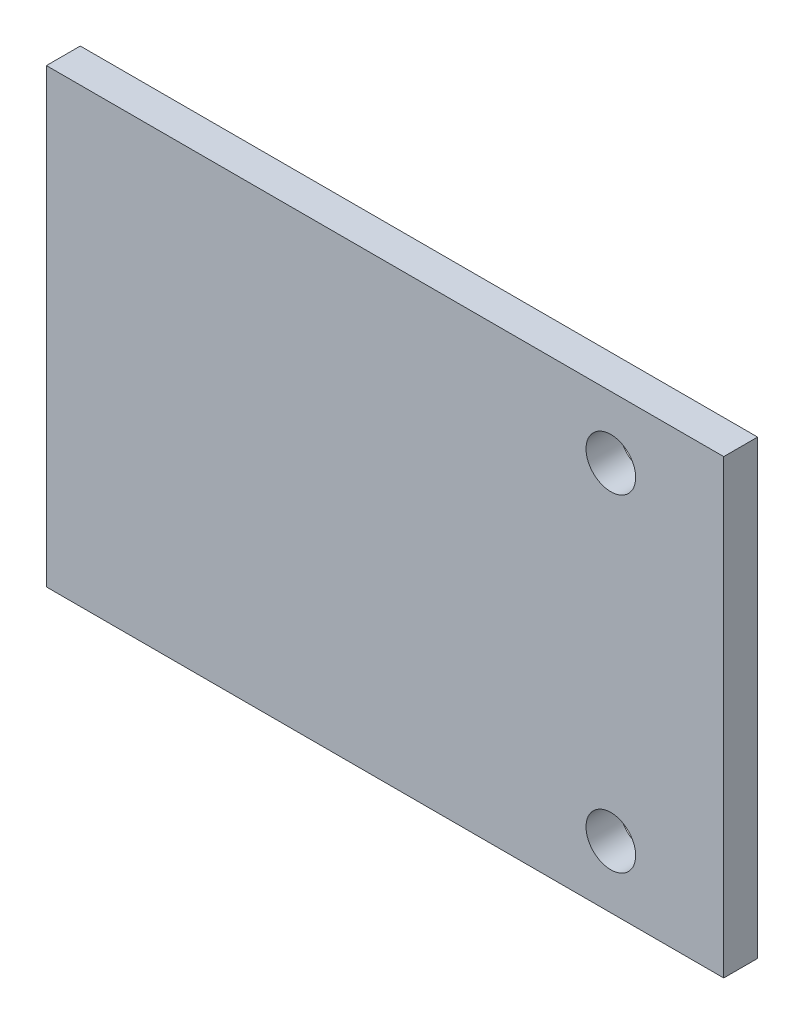
ISO-10303-21;
HEADER;
FILE_DESCRIPTION(('STEP AP214'),'2;1');
FILE_NAME('part.step','',(''),(''),'','','');
FILE_SCHEMA(('AUTOMOTIVE_DESIGN { 1 0 10303 214 1 1 1 1 }'));
ENDSEC;
DATA;
#1=APPLICATION_CONTEXT('core data for automotive mechanical design processes');
#2=APPLICATION_PROTOCOL_DEFINITION('international standard','automotive_design',2000,#1);
#3=PRODUCT_CONTEXT('',#1,'mechanical');
#4=PRODUCT('Part','Part','',(#3));
#5=PRODUCT_RELATED_PRODUCT_CATEGORY('part','',(#4));
#6=PRODUCT_DEFINITION_FORMATION('','',#4);
#7=PRODUCT_DEFINITION_CONTEXT('part definition',#1,'design');
#8=PRODUCT_DEFINITION('design','',#6,#7);
#9=PRODUCT_DEFINITION_SHAPE('','',#8);
#10=(LENGTH_UNIT() NAMED_UNIT(*) SI_UNIT(.MILLI.,.METRE.));
#11=(NAMED_UNIT(*) PLANE_ANGLE_UNIT() SI_UNIT($,.RADIAN.));
#12=(NAMED_UNIT(*) SI_UNIT($,.STERADIAN.) SOLID_ANGLE_UNIT());
#13=UNCERTAINTY_MEASURE_WITH_UNIT(LENGTH_MEASURE(1.E-05),#10,'distance_accuracy_value','');
#14=(GEOMETRIC_REPRESENTATION_CONTEXT(3) GLOBAL_UNCERTAINTY_ASSIGNED_CONTEXT((#13)) GLOBAL_UNIT_ASSIGNED_CONTEXT((#10,
#11,#12)) REPRESENTATION_CONTEXT('',''));
#15=CARTESIAN_POINT('',(0.,0.,0.));
#16=DIRECTION('',(0.,0.,1.));
#17=DIRECTION('',(1.,0.,0.));
#18=AXIS2_PLACEMENT_3D('',#15,#16,#17);
#19=CARTESIAN_POINT('',(30.,20.,3.));
#20=DIRECTION('',(-1.,0.,0.));
#21=DIRECTION('',(0.,-1.,0.));
#22=AXIS2_PLACEMENT_3D('',#19,#20,#21);
#23=PLANE('',#22);
#24=DIRECTION('',(0.,1.,0.));
#25=VECTOR('',#24,1.);
#26=CARTESIAN_POINT('',(30.,20.,0.));
#27=LINE('',#26,#25);
#28=CARTESIAN_POINT('',(30.,-20.,0.));
#29=VERTEX_POINT('',#28);
#30=CARTESIAN_POINT('',(30.,20.,0.));
#31=VERTEX_POINT('',#30);
#32=EDGE_CURVE('E99',#29,#31,#27,.T.);
#33=ORIENTED_EDGE('',*,*,#32,.T.);
#34=DIRECTION('',(0.,0.,-1.));
#35=VECTOR('',#34,1.);
#36=CARTESIAN_POINT('',(30.,20.,3.));
#37=LINE('',#36,#35);
#38=CARTESIAN_POINT('',(30.,20.,3.));
#39=VERTEX_POINT('',#38);
#40=EDGE_CURVE('E11',#39,#31,#37,.T.);
#41=ORIENTED_EDGE('',*,*,#40,.F.);
#42=DIRECTION('',(0.,1.,0.));
#43=VECTOR('',#42,1.);
#44=CARTESIAN_POINT('',(30.,20.,3.));
#45=LINE('',#44,#43);
#46=CARTESIAN_POINT('',(30.,-20.,3.));
#47=VERTEX_POINT('',#46);
#48=EDGE_CURVE('E87',#47,#39,#45,.T.);
#49=ORIENTED_EDGE('',*,*,#48,.F.);
#50=DIRECTION('',(0.,0.,-1.));
#51=VECTOR('',#50,1.);
#52=CARTESIAN_POINT('',(30.,-20.,3.));
#53=LINE('',#52,#51);
#54=EDGE_CURVE('E95',#47,#29,#53,.T.);
#55=ORIENTED_EDGE('',*,*,#54,.T.);
#56=EDGE_LOOP('',(#33,#41,#49,#55));
#57=FACE_BOUND('',#56,.T.);
#58=ADVANCED_FACE('F36',(#57),#23,.F.);
#59=CARTESIAN_POINT('',(-30.,20.,3.));
#60=DIRECTION('',(0.,-1.,0.));
#61=DIRECTION('',(0.,0.,-1.));
#62=AXIS2_PLACEMENT_3D('',#59,#60,#61);
#63=PLANE('',#62);
#64=DIRECTION('',(-1.,0.,0.));
#65=VECTOR('',#64,1.);
#66=CARTESIAN_POINT('',(-30.,20.,0.));
#67=LINE('',#66,#65);
#68=CARTESIAN_POINT('',(-30.,20.,0.));
#69=VERTEX_POINT('',#68);
#70=EDGE_CURVE('E91',#31,#69,#67,.T.);
#71=ORIENTED_EDGE('',*,*,#70,.T.);
#72=DIRECTION('',(0.,0.,-1.));
#73=VECTOR('',#72,1.);
#74=CARTESIAN_POINT('',(-30.,20.,3.));
#75=LINE('',#74,#73);
#76=CARTESIAN_POINT('',(-30.,20.,3.));
#77=VERTEX_POINT('',#76);
#78=EDGE_CURVE('E44',#77,#69,#75,.T.);
#79=ORIENTED_EDGE('',*,*,#78,.F.);
#80=DIRECTION('',(-1.,0.,0.));
#81=VECTOR('',#80,1.);
#82=CARTESIAN_POINT('',(-30.,20.,3.));
#83=LINE('',#82,#81);
#84=EDGE_CURVE('E82',#39,#77,#83,.T.);
#85=ORIENTED_EDGE('',*,*,#84,.F.);
#86=ORIENTED_EDGE('',*,*,#40,.T.);
#87=EDGE_LOOP('',(#71,#79,#85,#86));
#88=FACE_BOUND('',#87,.T.);
#89=ADVANCED_FACE('F90',(#88),#63,.F.);
#90=CARTESIAN_POINT('',(-30.,20.,3.));
#91=DIRECTION('',(1.,0.,0.));
#92=DIRECTION('',(0.,1.,0.));
#93=AXIS2_PLACEMENT_3D('',#90,#91,#92);
#94=PLANE('',#93);
#95=DIRECTION('',(0.,-1.,0.));
#96=VECTOR('',#95,1.);
#97=CARTESIAN_POINT('',(-30.,20.,0.));
#98=LINE('',#97,#96);
#99=CARTESIAN_POINT('',(-30.,-20.,0.));
#100=VERTEX_POINT('',#99);
#101=EDGE_CURVE('E69',#69,#100,#98,.T.);
#102=ORIENTED_EDGE('',*,*,#101,.T.);
#103=DIRECTION('',(0.,0.,-1.));
#104=VECTOR('',#103,1.);
#105=CARTESIAN_POINT('',(-30.,-20.,3.));
#106=LINE('',#105,#104);
#107=CARTESIAN_POINT('',(-30.,-20.,3.));
#108=VERTEX_POINT('',#107);
#109=EDGE_CURVE('E92',#108,#100,#106,.T.);
#110=ORIENTED_EDGE('',*,*,#109,.F.);
#111=DIRECTION('',(0.,-1.,0.));
#112=VECTOR('',#111,1.);
#113=CARTESIAN_POINT('',(-30.,20.,3.));
#114=LINE('',#113,#112);
#115=EDGE_CURVE('E85',#77,#108,#114,.T.);
#116=ORIENTED_EDGE('',*,*,#115,.F.);
#117=ORIENTED_EDGE('',*,*,#78,.T.);
#118=EDGE_LOOP('',(#102,#110,#116,#117));
#119=FACE_BOUND('',#118,.T.);
#120=ADVANCED_FACE('F93',(#119),#94,.F.);
#121=CARTESIAN_POINT('',(-30.,-20.,3.));
#122=DIRECTION('',(0.,1.,0.));
#123=DIRECTION('',(0.,0.,1.));
#124=AXIS2_PLACEMENT_3D('',#121,#122,#123);
#125=PLANE('',#124);
#126=DIRECTION('',(1.,0.,0.));
#127=VECTOR('',#126,1.);
#128=CARTESIAN_POINT('',(-30.,-20.,0.));
#129=LINE('',#128,#127);
#130=EDGE_CURVE('E75',#100,#29,#129,.T.);
#131=ORIENTED_EDGE('',*,*,#130,.T.);
#132=ORIENTED_EDGE('',*,*,#54,.F.);
#133=DIRECTION('',(1.,0.,0.));
#134=VECTOR('',#133,1.);
#135=CARTESIAN_POINT('',(-30.,-20.,3.));
#136=LINE('',#135,#134);
#137=EDGE_CURVE('E52',#108,#47,#136,.T.);
#138=ORIENTED_EDGE('',*,*,#137,.F.);
#139=ORIENTED_EDGE('',*,*,#109,.T.);
#140=EDGE_LOOP('',(#131,#132,#138,#139));
#141=FACE_BOUND('',#140,.T.);
#142=ADVANCED_FACE('F107',(#141),#125,.F.);
#143=CARTESIAN_POINT('',(0.,0.,3.));
#144=DIRECTION('',(0.,0.,1.));
#145=DIRECTION('',(1.,0.,0.));
#146=AXIS2_PLACEMENT_3D('',#143,#144,#145);
#147=PLANE('',#146);
#148=CARTESIAN_POINT('',(20.,14.5,3.));
#149=DIRECTION('',(0.,0.,1.));
#150=DIRECTION('',(1.,0.,0.));
#151=AXIS2_PLACEMENT_3D('',#148,#149,#150);
#152=CIRCLE('',#151,2.2);
#153=CARTESIAN_POINT('',(22.2,14.5,3.));
#154=VERTEX_POINT('',#153);
#155=EDGE_CURVE('E119',#154,#154,#152,.T.);
#156=ORIENTED_EDGE('',*,*,#155,.F.);
#157=EDGE_LOOP('',(#156));
#158=FACE_BOUND('',#157,.T.);
#159=CARTESIAN_POINT('',(20.,-14.5,3.));
#160=DIRECTION('',(0.,0.,1.));
#161=DIRECTION('',(1.,0.,0.));
#162=AXIS2_PLACEMENT_3D('',#159,#160,#161);
#163=CIRCLE('',#162,2.2);
#164=CARTESIAN_POINT('',(22.2,-14.5,3.));
#165=VERTEX_POINT('',#164);
#166=EDGE_CURVE('E113',#165,#165,#163,.T.);
#167=ORIENTED_EDGE('',*,*,#166,.F.);
#168=EDGE_LOOP('',(#167));
#169=FACE_BOUND('',#168,.T.);
#170=ORIENTED_EDGE('',*,*,#48,.T.);
#171=ORIENTED_EDGE('',*,*,#84,.T.);
#172=ORIENTED_EDGE('',*,*,#115,.T.);
#173=ORIENTED_EDGE('',*,*,#137,.T.);
#174=EDGE_LOOP('',(#170,#171,#172,#173));
#175=FACE_BOUND('',#174,.T.);
#176=ADVANCED_FACE('F83',(#158,#169,#175),#147,.T.);
#177=CARTESIAN_POINT('',(0.,0.,0.));
#178=DIRECTION('',(0.,0.,1.));
#179=DIRECTION('',(1.,0.,0.));
#180=AXIS2_PLACEMENT_3D('',#177,#178,#179);
#181=PLANE('',#180);
#182=CARTESIAN_POINT('',(20.,14.5,0.));
#183=DIRECTION('',(0.,0.,1.));
#184=DIRECTION('',(1.,0.,0.));
#185=AXIS2_PLACEMENT_3D('',#182,#183,#184);
#186=CIRCLE('',#185,2.2);
#187=CARTESIAN_POINT('',(22.2,14.5,0.));
#188=VERTEX_POINT('',#187);
#189=EDGE_CURVE('E102',#188,#188,#186,.T.);
#190=ORIENTED_EDGE('',*,*,#189,.T.);
#191=EDGE_LOOP('',(#190));
#192=FACE_BOUND('',#191,.T.);
#193=CARTESIAN_POINT('',(20.,-14.5,0.));
#194=DIRECTION('',(0.,0.,1.));
#195=DIRECTION('',(1.,0.,0.));
#196=AXIS2_PLACEMENT_3D('',#193,#194,#195);
#197=CIRCLE('',#196,2.2);
#198=CARTESIAN_POINT('',(22.2,-14.5,0.));
#199=VERTEX_POINT('',#198);
#200=EDGE_CURVE('E116',#199,#199,#197,.T.);
#201=ORIENTED_EDGE('',*,*,#200,.T.);
#202=EDGE_LOOP('',(#201));
#203=FACE_BOUND('',#202,.T.);
#204=ORIENTED_EDGE('',*,*,#32,.F.);
#205=ORIENTED_EDGE('',*,*,#130,.F.);
#206=ORIENTED_EDGE('',*,*,#101,.F.);
#207=ORIENTED_EDGE('',*,*,#70,.F.);
#208=EDGE_LOOP('',(#204,#205,#206,#207));
#209=FACE_BOUND('',#208,.T.);
#210=ADVANCED_FACE('F110',(#192,#203,#209),#181,.F.);
#211=CARTESIAN_POINT('',(20.,-14.5,0.));
#212=DIRECTION('',(0.,0.,1.));
#213=DIRECTION('',(1.,0.,0.));
#214=AXIS2_PLACEMENT_3D('',#211,#212,#213);
#215=CYLINDRICAL_SURFACE('',#214,2.2);
#216=ORIENTED_EDGE('',*,*,#200,.F.);
#217=EDGE_LOOP('',(#216));
#218=FACE_BOUND('',#217,.T.);
#219=ORIENTED_EDGE('',*,*,#166,.T.);
#220=EDGE_LOOP('',(#219));
#221=FACE_BOUND('',#220,.T.);
#222=ADVANCED_FACE('F130',(#218,#221),#215,.F.);
#223=CARTESIAN_POINT('',(20.,14.5,0.));
#224=DIRECTION('',(0.,0.,1.));
#225=DIRECTION('',(1.,0.,0.));
#226=AXIS2_PLACEMENT_3D('',#223,#224,#225);
#227=CYLINDRICAL_SURFACE('',#226,2.2);
#228=ORIENTED_EDGE('',*,*,#189,.F.);
#229=EDGE_LOOP('',(#228));
#230=FACE_BOUND('',#229,.T.);
#231=ORIENTED_EDGE('',*,*,#155,.T.);
#232=EDGE_LOOP('',(#231));
#233=FACE_BOUND('',#232,.T.);
#234=ADVANCED_FACE('F127',(#230,#233),#227,.F.);
#235=CLOSED_SHELL('',(#58,#89,#120,#142,#176,#210,#222,#234));
#236=MANIFOLD_SOLID_BREP('B2',#235);
#237=ADVANCED_BREP_SHAPE_REPRESENTATION('',(#18,#236),#14);
#238=SHAPE_DEFINITION_REPRESENTATION(#9,#237);
ENDSEC;
END-ISO-10303-21;
